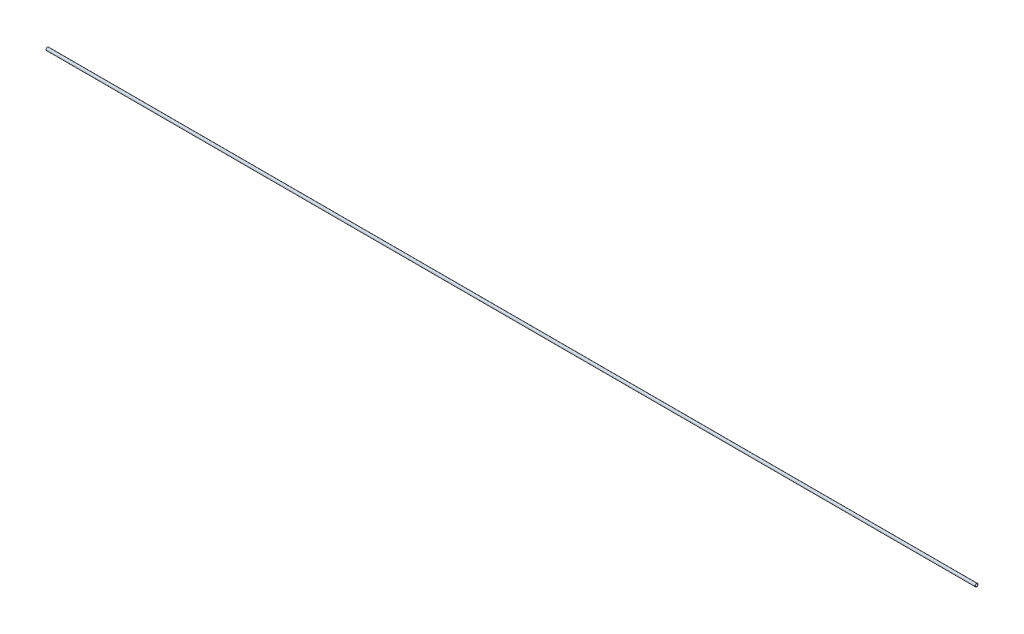
ISO-10303-21;
HEADER;
FILE_DESCRIPTION(('STEP AP214'),'2;1');
FILE_NAME('part.step','',(''),(''),'','','');
FILE_SCHEMA(('AUTOMOTIVE_DESIGN { 1 0 10303 214 1 1 1 1 }'));
ENDSEC;
DATA;
#1=APPLICATION_CONTEXT('core data for automotive mechanical design processes');
#2=APPLICATION_PROTOCOL_DEFINITION('international standard','automotive_design',2000,#1);
#3=PRODUCT_CONTEXT('',#1,'mechanical');
#4=PRODUCT('Part','Part','',(#3));
#5=PRODUCT_RELATED_PRODUCT_CATEGORY('part','',(#4));
#6=PRODUCT_DEFINITION_FORMATION('','',#4);
#7=PRODUCT_DEFINITION_CONTEXT('part definition',#1,'design');
#8=PRODUCT_DEFINITION('design','',#6,#7);
#9=PRODUCT_DEFINITION_SHAPE('','',#8);
#10=(LENGTH_UNIT() NAMED_UNIT(*) SI_UNIT(.MILLI.,.METRE.));
#11=(NAMED_UNIT(*) PLANE_ANGLE_UNIT() SI_UNIT($,.RADIAN.));
#12=(NAMED_UNIT(*) SI_UNIT($,.STERADIAN.) SOLID_ANGLE_UNIT());
#13=UNCERTAINTY_MEASURE_WITH_UNIT(LENGTH_MEASURE(1.E-05),#10,'distance_accuracy_value','');
#14=(GEOMETRIC_REPRESENTATION_CONTEXT(3) GLOBAL_UNCERTAINTY_ASSIGNED_CONTEXT((#13)) GLOBAL_UNIT_ASSIGNED_CONTEXT((#10,
#11,#12)) REPRESENTATION_CONTEXT('',''));
#15=CARTESIAN_POINT('',(0.,0.,0.));
#16=DIRECTION('',(0.,0.,1.));
#17=DIRECTION('',(1.,0.,0.));
#18=AXIS2_PLACEMENT_3D('',#15,#16,#17);
#19=CARTESIAN_POINT('',(1219.2,0.,0.));
#20=DIRECTION('',(-1.,0.,0.));
#21=DIRECTION('',(0.,0.,1.));
#22=AXIS2_PLACEMENT_3D('',#19,#20,#21);
#23=CYLINDRICAL_SURFACE('',#22,1.905);
#24=CARTESIAN_POINT('',(1219.2,0.,0.));
#25=DIRECTION('',(1.,0.,0.));
#26=DIRECTION('',(0.,0.,-1.));
#27=AXIS2_PLACEMENT_3D('',#24,#25,#26);
#28=CIRCLE('',#27,1.905);
#29=CARTESIAN_POINT('',(1219.2,0.,-1.905));
#30=VERTEX_POINT('',#29);
#31=EDGE_CURVE('E10',#30,#30,#28,.T.);
#32=ORIENTED_EDGE('',*,*,#31,.F.);
#33=EDGE_LOOP('',(#32));
#34=FACE_BOUND('',#33,.T.);
#35=CARTESIAN_POINT('',(0.,0.,0.));
#36=DIRECTION('',(1.,0.,0.));
#37=DIRECTION('',(0.,0.,-1.));
#38=AXIS2_PLACEMENT_3D('',#35,#36,#37);
#39=CIRCLE('',#38,1.905);
#40=CARTESIAN_POINT('',(0.,0.,-1.905));
#41=VERTEX_POINT('',#40);
#42=EDGE_CURVE('E33',#41,#41,#39,.T.);
#43=ORIENTED_EDGE('',*,*,#42,.T.);
#44=EDGE_LOOP('',(#43));
#45=FACE_BOUND('',#44,.T.);
#46=ADVANCED_FACE('F30',(#34,#45),#23,.T.);
#47=CARTESIAN_POINT('',(1219.2,0.,0.));
#48=DIRECTION('',(1.,0.,0.));
#49=DIRECTION('',(0.,0.,-1.));
#50=AXIS2_PLACEMENT_3D('',#47,#48,#49);
#51=PLANE('',#50);
#52=CARTESIAN_POINT('',(1219.2,0.,0.));
#53=DIRECTION('',(-1.,0.,0.));
#54=DIRECTION('',(0.,0.,1.));
#55=AXIS2_PLACEMENT_3D('',#52,#53,#54);
#56=CIRCLE('',#55,1.5875);
#57=CARTESIAN_POINT('',(1219.2,0.,1.5875));
#58=VERTEX_POINT('',#57);
#59=EDGE_CURVE('E40',#58,#58,#56,.T.);
#60=ORIENTED_EDGE('',*,*,#59,.T.);
#61=EDGE_LOOP('',(#60));
#62=FACE_BOUND('',#61,.T.);
#63=ORIENTED_EDGE('',*,*,#31,.T.);
#64=EDGE_LOOP('',(#63));
#65=FACE_BOUND('',#64,.T.);
#66=ADVANCED_FACE('F48',(#62,#65),#51,.T.);
#67=CARTESIAN_POINT('',(0.,0.,0.));
#68=DIRECTION('',(1.,0.,0.));
#69=DIRECTION('',(0.,0.,-1.));
#70=AXIS2_PLACEMENT_3D('',#67,#68,#69);
#71=PLANE('',#70);
#72=CARTESIAN_POINT('',(0.,0.,0.));
#73=DIRECTION('',(-1.,0.,0.));
#74=DIRECTION('',(0.,0.,1.));
#75=AXIS2_PLACEMENT_3D('',#72,#73,#74);
#76=CIRCLE('',#75,1.5875);
#77=CARTESIAN_POINT('',(0.,0.,1.5875));
#78=VERTEX_POINT('',#77);
#79=EDGE_CURVE('E42',#78,#78,#76,.T.);
#80=ORIENTED_EDGE('',*,*,#79,.F.);
#81=EDGE_LOOP('',(#80));
#82=FACE_BOUND('',#81,.T.);
#83=ORIENTED_EDGE('',*,*,#42,.F.);
#84=EDGE_LOOP('',(#83));
#85=FACE_BOUND('',#84,.T.);
#86=ADVANCED_FACE('F53',(#82,#85),#71,.F.);
#87=CARTESIAN_POINT('',(1219.2,0.,0.));
#88=DIRECTION('',(-1.,0.,0.));
#89=DIRECTION('',(0.,0.,1.));
#90=AXIS2_PLACEMENT_3D('',#87,#88,#89);
#91=CYLINDRICAL_SURFACE('',#90,1.5875);
#92=ORIENTED_EDGE('',*,*,#59,.F.);
#93=EDGE_LOOP('',(#92));
#94=FACE_BOUND('',#93,.T.);
#95=ORIENTED_EDGE('',*,*,#79,.T.);
#96=EDGE_LOOP('',(#95));
#97=FACE_BOUND('',#96,.T.);
#98=ADVANCED_FACE('F50',(#94,#97),#91,.F.);
#99=CLOSED_SHELL('',(#46,#66,#86,#98));
#100=MANIFOLD_SOLID_BREP('B2',#99);
#101=ADVANCED_BREP_SHAPE_REPRESENTATION('',(#18,#100),#14);
#102=SHAPE_DEFINITION_REPRESENTATION(#9,#101);
ENDSEC;
END-ISO-10303-21;
